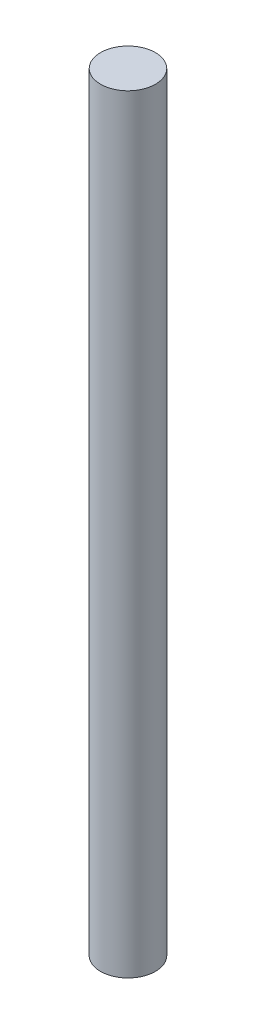
ISO-10303-21;
HEADER;
FILE_DESCRIPTION(('STEP AP214'),'2;1');
FILE_NAME('part.step','',(''),(''),'','','');
FILE_SCHEMA(('AUTOMOTIVE_DESIGN { 1 0 10303 214 1 1 1 1 }'));
ENDSEC;
DATA;
#1=APPLICATION_CONTEXT('core data for automotive mechanical design processes');
#2=APPLICATION_PROTOCOL_DEFINITION('international standard','automotive_design',2000,#1);
#3=PRODUCT_CONTEXT('',#1,'mechanical');
#4=PRODUCT('Part','Part','',(#3));
#5=PRODUCT_RELATED_PRODUCT_CATEGORY('part','',(#4));
#6=PRODUCT_DEFINITION_FORMATION('','',#4);
#7=PRODUCT_DEFINITION_CONTEXT('part definition',#1,'design');
#8=PRODUCT_DEFINITION('design','',#6,#7);
#9=PRODUCT_DEFINITION_SHAPE('','',#8);
#10=(LENGTH_UNIT() NAMED_UNIT(*) SI_UNIT(.MILLI.,.METRE.));
#11=(NAMED_UNIT(*) PLANE_ANGLE_UNIT() SI_UNIT($,.RADIAN.));
#12=(NAMED_UNIT(*) SI_UNIT($,.STERADIAN.) SOLID_ANGLE_UNIT());
#13=UNCERTAINTY_MEASURE_WITH_UNIT(LENGTH_MEASURE(1.E-05),#10,'distance_accuracy_value','');
#14=(GEOMETRIC_REPRESENTATION_CONTEXT(3) GLOBAL_UNCERTAINTY_ASSIGNED_CONTEXT((#13)) GLOBAL_UNIT_ASSIGNED_CONTEXT((#10,
#11,#12)) REPRESENTATION_CONTEXT('',''));
#15=CARTESIAN_POINT('',(0.,0.,0.));
#16=DIRECTION('',(0.,0.,1.));
#17=DIRECTION('',(1.,0.,0.));
#18=AXIS2_PLACEMENT_3D('',#15,#16,#17);
#19=CARTESIAN_POINT('',(0.,88.9,0.));
#20=DIRECTION('',(0.,-1.,0.));
#21=DIRECTION('',(0.,0.,-1.));
#22=AXIS2_PLACEMENT_3D('',#19,#20,#21);
#23=CYLINDRICAL_SURFACE('',#22,3.175);
#24=CARTESIAN_POINT('',(0.,88.9,0.));
#25=DIRECTION('',(0.,1.,0.));
#26=DIRECTION('',(0.,0.,1.));
#27=AXIS2_PLACEMENT_3D('',#24,#25,#26);
#28=CIRCLE('',#27,3.175);
#29=CARTESIAN_POINT('',(0.,88.9,3.175));
#30=VERTEX_POINT('',#29);
#31=EDGE_CURVE('E10',#30,#30,#28,.T.);
#32=ORIENTED_EDGE('',*,*,#31,.F.);
#33=EDGE_LOOP('',(#32));
#34=FACE_BOUND('',#33,.T.);
#35=CARTESIAN_POINT('',(0.,0.,0.));
#36=DIRECTION('',(0.,1.,0.));
#37=DIRECTION('',(0.,0.,1.));
#38=AXIS2_PLACEMENT_3D('',#35,#36,#37);
#39=CIRCLE('',#38,3.175);
#40=CARTESIAN_POINT('',(0.,0.,3.175));
#41=VERTEX_POINT('',#40);
#42=EDGE_CURVE('E40',#41,#41,#39,.T.);
#43=ORIENTED_EDGE('',*,*,#42,.T.);
#44=EDGE_LOOP('',(#43));
#45=FACE_BOUND('',#44,.T.);
#46=ADVANCED_FACE('F37',(#34,#45),#23,.T.);
#47=CARTESIAN_POINT('',(0.,88.9,0.));
#48=DIRECTION('',(0.,1.,0.));
#49=DIRECTION('',(0.,0.,1.));
#50=AXIS2_PLACEMENT_3D('',#47,#48,#49);
#51=PLANE('',#50);
#52=ORIENTED_EDGE('',*,*,#31,.T.);
#53=EDGE_LOOP('',(#52));
#54=FACE_BOUND('',#53,.T.);
#55=ADVANCED_FACE('F54',(#54),#51,.T.);
#56=CARTESIAN_POINT('',(0.,0.,0.));
#57=DIRECTION('',(0.,1.,0.));
#58=DIRECTION('',(0.,0.,1.));
#59=AXIS2_PLACEMENT_3D('',#56,#57,#58);
#60=PLANE('',#59);
#61=ORIENTED_EDGE('',*,*,#42,.F.);
#62=EDGE_LOOP('',(#61));
#63=FACE_BOUND('',#62,.T.);
#64=ADVANCED_FACE('F52',(#63),#60,.F.);
#65=CLOSED_SHELL('',(#46,#55,#64));
#66=MANIFOLD_SOLID_BREP('B2',#65);
#67=ADVANCED_BREP_SHAPE_REPRESENTATION('',(#18,#66),#14);
#68=SHAPE_DEFINITION_REPRESENTATION(#9,#67);
ENDSEC;
END-ISO-10303-21;
